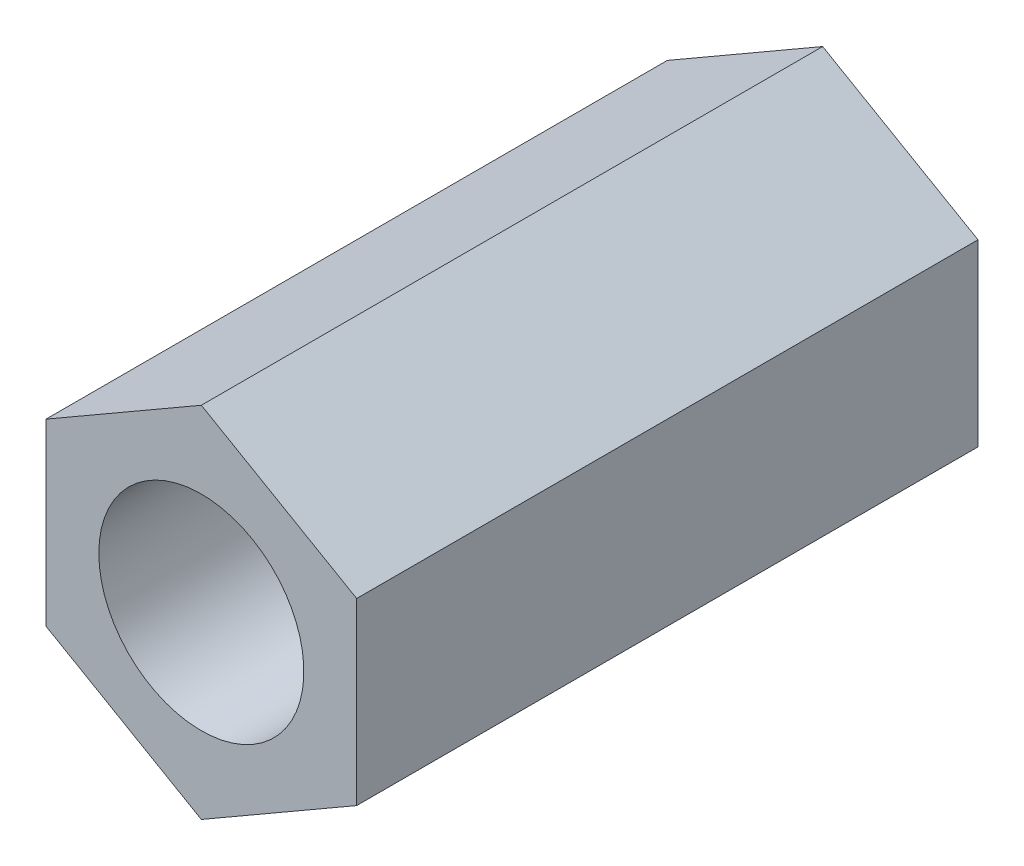
ISO-10303-21;
HEADER;
FILE_DESCRIPTION(('STEP AP214'),'2;1');
FILE_NAME('part.step','',(''),(''),'','','');
FILE_SCHEMA(('AUTOMOTIVE_DESIGN { 1 0 10303 214 1 1 1 1 }'));
ENDSEC;
DATA;
#1=APPLICATION_CONTEXT('core data for automotive mechanical design processes');
#2=APPLICATION_PROTOCOL_DEFINITION('international standard','automotive_design',2000,#1);
#3=PRODUCT_CONTEXT('',#1,'mechanical');
#4=PRODUCT('Part','Part','',(#3));
#5=PRODUCT_RELATED_PRODUCT_CATEGORY('part','',(#4));
#6=PRODUCT_DEFINITION_FORMATION('','',#4);
#7=PRODUCT_DEFINITION_CONTEXT('part definition',#1,'design');
#8=PRODUCT_DEFINITION('design','',#6,#7);
#9=PRODUCT_DEFINITION_SHAPE('','',#8);
#10=(LENGTH_UNIT() NAMED_UNIT(*) SI_UNIT(.MILLI.,.METRE.));
#11=(NAMED_UNIT(*) PLANE_ANGLE_UNIT() SI_UNIT($,.RADIAN.));
#12=(NAMED_UNIT(*) SI_UNIT($,.STERADIAN.) SOLID_ANGLE_UNIT());
#13=UNCERTAINTY_MEASURE_WITH_UNIT(LENGTH_MEASURE(1.E-05),#10,'distance_accuracy_value','');
#14=(GEOMETRIC_REPRESENTATION_CONTEXT(3) GLOBAL_UNCERTAINTY_ASSIGNED_CONTEXT((#13)) GLOBAL_UNIT_ASSIGNED_CONTEXT((#10,
#11,#12)) REPRESENTATION_CONTEXT('',''));
#15=CARTESIAN_POINT('',(0.,0.,0.));
#16=DIRECTION('',(0.,0.,1.));
#17=DIRECTION('',(1.,0.,0.));
#18=AXIS2_PLACEMENT_3D('',#15,#16,#17);
#19=CARTESIAN_POINT('',(0.,-3.66617420935412,12.7));
#20=DIRECTION('',(-0.5,0.866025403784439,0.));
#21=DIRECTION('',(-0.866025403784439,-0.5,0.));
#22=AXIS2_PLACEMENT_3D('',#19,#20,#21);
#23=PLANE('',#22);
#24=DIRECTION('',(0.866025403784439,0.5,0.));
#25=VECTOR('',#24,1.);
#26=CARTESIAN_POINT('',(0.,-3.66617420935412,12.7));
#27=LINE('',#26,#25);
#28=CARTESIAN_POINT('',(0.,-3.66617420935412,12.7));
#29=VERTEX_POINT('',#28);
#30=CARTESIAN_POINT('',(3.175,-1.83308710467706,12.7));
#31=VERTEX_POINT('',#30);
#32=EDGE_CURVE('E109',#29,#31,#27,.T.);
#33=ORIENTED_EDGE('',*,*,#32,.F.);
#34=DIRECTION('',(0.,0.,1.));
#35=VECTOR('',#34,1.);
#36=CARTESIAN_POINT('',(0.,-3.66617420935412,12.7));
#37=LINE('',#36,#35);
#38=CARTESIAN_POINT('',(0.,-3.66617420935412,0.));
#39=VERTEX_POINT('',#38);
#40=EDGE_CURVE('E94',#29,#39,#37,.F.);
#41=ORIENTED_EDGE('',*,*,#40,.T.);
#42=DIRECTION('',(0.866025403784439,0.5,0.));
#43=VECTOR('',#42,1.);
#44=CARTESIAN_POINT('',(0.,-3.66617420935412,0.));
#45=LINE('',#44,#43);
#46=CARTESIAN_POINT('',(3.175,-1.83308710467706,0.));
#47=VERTEX_POINT('',#46);
#48=EDGE_CURVE('E110',#39,#47,#45,.T.);
#49=ORIENTED_EDGE('',*,*,#48,.T.);
#50=DIRECTION('',(0.,0.,1.));
#51=VECTOR('',#50,1.);
#52=CARTESIAN_POINT('',(3.175,-1.83308710467706,12.7));
#53=LINE('',#52,#51);
#54=EDGE_CURVE('E103',#47,#31,#53,.T.);
#55=ORIENTED_EDGE('',*,*,#54,.T.);
#56=EDGE_LOOP('',(#33,#41,#49,#55));
#57=FACE_BOUND('',#56,.T.);
#58=ADVANCED_FACE('F17',(#57),#23,.F.);
#59=CARTESIAN_POINT('',(3.175,-1.83308710467706,12.7));
#60=DIRECTION('',(-1.,0.,0.));
#61=DIRECTION('',(0.,-1.,0.));
#62=AXIS2_PLACEMENT_3D('',#59,#60,#61);
#63=PLANE('',#62);
#64=DIRECTION('',(0.,1.,0.));
#65=VECTOR('',#64,1.);
#66=CARTESIAN_POINT('',(3.175,3.66617420935412,12.7));
#67=LINE('',#66,#65);
#68=CARTESIAN_POINT('',(3.175,1.83308710467706,12.7));
#69=VERTEX_POINT('',#68);
#70=EDGE_CURVE('E112',#31,#69,#67,.T.);
#71=ORIENTED_EDGE('',*,*,#70,.F.);
#72=ORIENTED_EDGE('',*,*,#54,.F.);
#73=DIRECTION('',(0.,1.,0.));
#74=VECTOR('',#73,1.);
#75=CARTESIAN_POINT('',(3.175,3.66617420935412,0.));
#76=LINE('',#75,#74);
#77=CARTESIAN_POINT('',(3.175,1.83308710467706,0.));
#78=VERTEX_POINT('',#77);
#79=EDGE_CURVE('E117',#47,#78,#76,.T.);
#80=ORIENTED_EDGE('',*,*,#79,.T.);
#81=DIRECTION('',(0.,0.,1.));
#82=VECTOR('',#81,1.);
#83=CARTESIAN_POINT('',(3.175,1.83308710467706,12.7));
#84=LINE('',#83,#82);
#85=EDGE_CURVE('E66',#78,#69,#84,.T.);
#86=ORIENTED_EDGE('',*,*,#85,.T.);
#87=EDGE_LOOP('',(#71,#72,#80,#86));
#88=FACE_BOUND('',#87,.T.);
#89=ADVANCED_FACE('F113',(#88),#63,.F.);
#90=CARTESIAN_POINT('',(3.175,1.83308710467706,12.7));
#91=DIRECTION('',(-0.5,-0.866025403784439,0.));
#92=DIRECTION('',(0.866025403784439,-0.5,0.));
#93=AXIS2_PLACEMENT_3D('',#90,#91,#92);
#94=PLANE('',#93);
#95=DIRECTION('',(-0.866025403784439,0.5,0.));
#96=VECTOR('',#95,1.);
#97=CARTESIAN_POINT('',(3.175,1.83308710467706,12.7));
#98=LINE('',#97,#96);
#99=CARTESIAN_POINT('',(0.,3.66617420935412,12.7));
#100=VERTEX_POINT('',#99);
#101=EDGE_CURVE('E114',#69,#100,#98,.T.);
#102=ORIENTED_EDGE('',*,*,#101,.F.);
#103=ORIENTED_EDGE('',*,*,#85,.F.);
#104=DIRECTION('',(-0.866025403784438,0.5,0.));
#105=VECTOR('',#104,1.);
#106=CARTESIAN_POINT('',(3.175,1.83308710467706,0.));
#107=LINE('',#106,#105);
#108=CARTESIAN_POINT('',(0.,3.66617420935412,0.));
#109=VERTEX_POINT('',#108);
#110=EDGE_CURVE('E87',#78,#109,#107,.T.);
#111=ORIENTED_EDGE('',*,*,#110,.T.);
#112=DIRECTION('',(0.,0.,1.));
#113=VECTOR('',#112,1.);
#114=CARTESIAN_POINT('',(0.,3.66617420935412,12.7));
#115=LINE('',#114,#113);
#116=EDGE_CURVE('E73',#109,#100,#115,.T.);
#117=ORIENTED_EDGE('',*,*,#116,.T.);
#118=EDGE_LOOP('',(#102,#103,#111,#117));
#119=FACE_BOUND('',#118,.T.);
#120=ADVANCED_FACE('F93',(#119),#94,.F.);
#121=CARTESIAN_POINT('',(0.,3.66617420935412,12.7));
#122=DIRECTION('',(0.5,-0.866025403784439,0.));
#123=DIRECTION('',(0.866025403784439,0.5,0.));
#124=AXIS2_PLACEMENT_3D('',#121,#122,#123);
#125=PLANE('',#124);
#126=DIRECTION('',(-0.866025403784439,-0.5,0.));
#127=VECTOR('',#126,1.);
#128=CARTESIAN_POINT('',(0.,3.66617420935412,12.7));
#129=LINE('',#128,#127);
#130=CARTESIAN_POINT('',(-3.175,1.83308710467706,12.7));
#131=VERTEX_POINT('',#130);
#132=EDGE_CURVE('E78',#100,#131,#129,.T.);
#133=ORIENTED_EDGE('',*,*,#132,.F.);
#134=ORIENTED_EDGE('',*,*,#116,.F.);
#135=DIRECTION('',(-0.866025403784439,-0.5,0.));
#136=VECTOR('',#135,1.);
#137=CARTESIAN_POINT('',(0.,3.66617420935412,0.));
#138=LINE('',#137,#136);
#139=CARTESIAN_POINT('',(-3.175,1.83308710467706,0.));
#140=VERTEX_POINT('',#139);
#141=EDGE_CURVE('E77',#109,#140,#138,.T.);
#142=ORIENTED_EDGE('',*,*,#141,.T.);
#143=DIRECTION('',(0.,0.,1.));
#144=VECTOR('',#143,1.);
#145=CARTESIAN_POINT('',(-3.175,1.83308710467706,12.7));
#146=LINE('',#145,#144);
#147=EDGE_CURVE('E79',#140,#131,#146,.T.);
#148=ORIENTED_EDGE('',*,*,#147,.T.);
#149=EDGE_LOOP('',(#133,#134,#142,#148));
#150=FACE_BOUND('',#149,.T.);
#151=ADVANCED_FACE('F75',(#150),#125,.F.);
#152=CARTESIAN_POINT('',(-3.175,1.83308710467706,12.7));
#153=DIRECTION('',(1.,0.,0.));
#154=DIRECTION('',(0.,1.,0.));
#155=AXIS2_PLACEMENT_3D('',#152,#153,#154);
#156=PLANE('',#155);
#157=DIRECTION('',(0.,1.,0.));
#158=VECTOR('',#157,1.);
#159=CARTESIAN_POINT('',(-3.175,3.66617420935412,12.7));
#160=LINE('',#159,#158);
#161=CARTESIAN_POINT('',(-3.175,-1.83308710467706,12.7));
#162=VERTEX_POINT('',#161);
#163=EDGE_CURVE('E33',#131,#162,#160,.F.);
#164=ORIENTED_EDGE('',*,*,#163,.F.);
#165=ORIENTED_EDGE('',*,*,#147,.F.);
#166=DIRECTION('',(0.,1.,0.));
#167=VECTOR('',#166,1.);
#168=CARTESIAN_POINT('',(-3.175,3.66617420935412,0.));
#169=LINE('',#168,#167);
#170=CARTESIAN_POINT('',(-3.175,-1.83308710467706,0.));
#171=VERTEX_POINT('',#170);
#172=EDGE_CURVE('E91',#140,#171,#169,.F.);
#173=ORIENTED_EDGE('',*,*,#172,.T.);
#174=DIRECTION('',(0.,0.,1.));
#175=VECTOR('',#174,1.);
#176=CARTESIAN_POINT('',(-3.175,-1.83308710467706,12.7));
#177=LINE('',#176,#175);
#178=EDGE_CURVE('E96',#171,#162,#177,.T.);
#179=ORIENTED_EDGE('',*,*,#178,.T.);
#180=EDGE_LOOP('',(#164,#165,#173,#179));
#181=FACE_BOUND('',#180,.T.);
#182=ADVANCED_FACE('F126',(#181),#156,.F.);
#183=CARTESIAN_POINT('',(-3.175,-1.83308710467706,12.7));
#184=DIRECTION('',(0.5,0.866025403784439,0.));
#185=DIRECTION('',(-0.866025403784439,0.5,0.));
#186=AXIS2_PLACEMENT_3D('',#183,#184,#185);
#187=PLANE('',#186);
#188=DIRECTION('',(0.866025403784438,-0.5,0.));
#189=VECTOR('',#188,1.);
#190=CARTESIAN_POINT('',(-3.175,-1.83308710467706,12.7));
#191=LINE('',#190,#189);
#192=EDGE_CURVE('E128',#162,#29,#191,.T.);
#193=ORIENTED_EDGE('',*,*,#192,.F.);
#194=ORIENTED_EDGE('',*,*,#178,.F.);
#195=DIRECTION('',(0.866025403784438,-0.5,0.));
#196=VECTOR('',#195,1.);
#197=CARTESIAN_POINT('',(-3.175,-1.83308710467706,0.));
#198=LINE('',#197,#196);
#199=EDGE_CURVE('E123',#171,#39,#198,.T.);
#200=ORIENTED_EDGE('',*,*,#199,.T.);
#201=ORIENTED_EDGE('',*,*,#40,.F.);
#202=EDGE_LOOP('',(#193,#194,#200,#201));
#203=FACE_BOUND('',#202,.T.);
#204=ADVANCED_FACE('F148',(#203),#187,.F.);
#205=CARTESIAN_POINT('',(0.,3.66617420935412,0.));
#206=DIRECTION('',(0.,0.,1.));
#207=DIRECTION('',(1.,0.,0.));
#208=AXIS2_PLACEMENT_3D('',#205,#206,#207);
#209=PLANE('',#208);
#210=ORIENTED_EDGE('',*,*,#48,.F.);
#211=ORIENTED_EDGE('',*,*,#199,.F.);
#212=ORIENTED_EDGE('',*,*,#172,.F.);
#213=ORIENTED_EDGE('',*,*,#141,.F.);
#214=ORIENTED_EDGE('',*,*,#110,.F.);
#215=ORIENTED_EDGE('',*,*,#79,.F.);
#216=EDGE_LOOP('',(#210,#211,#212,#213,#214,#215));
#217=FACE_BOUND('',#216,.T.);
#218=CARTESIAN_POINT('',(0.,0.,0.));
#219=DIRECTION('',(0.,0.,-1.));
#220=DIRECTION('',(-1.,0.,0.));
#221=AXIS2_PLACEMENT_3D('',#218,#219,#220);
#222=CIRCLE('',#221,2.0955);
#223=CARTESIAN_POINT('',(-2.0955,0.,0.));
#224=VERTEX_POINT('',#223);
#225=EDGE_CURVE('E20',#224,#224,#222,.F.);
#226=ORIENTED_EDGE('',*,*,#225,.T.);
#227=EDGE_LOOP('',(#226));
#228=FACE_BOUND('',#227,.T.);
#229=ADVANCED_FACE('F84',(#217,#228),#209,.F.);
#230=CARTESIAN_POINT('',(0.,3.66617420935412,12.7));
#231=DIRECTION('',(0.,0.,1.));
#232=DIRECTION('',(1.,0.,0.));
#233=AXIS2_PLACEMENT_3D('',#230,#231,#232);
#234=PLANE('',#233);
#235=ORIENTED_EDGE('',*,*,#163,.T.);
#236=ORIENTED_EDGE('',*,*,#192,.T.);
#237=ORIENTED_EDGE('',*,*,#32,.T.);
#238=ORIENTED_EDGE('',*,*,#70,.T.);
#239=ORIENTED_EDGE('',*,*,#101,.T.);
#240=ORIENTED_EDGE('',*,*,#132,.T.);
#241=EDGE_LOOP('',(#235,#236,#237,#238,#239,#240));
#242=FACE_BOUND('',#241,.T.);
#243=CARTESIAN_POINT('',(0.,0.,12.7));
#244=DIRECTION('',(0.,0.,-1.));
#245=DIRECTION('',(-1.,0.,0.));
#246=AXIS2_PLACEMENT_3D('',#243,#244,#245);
#247=CIRCLE('',#246,2.0955);
#248=CARTESIAN_POINT('',(-2.0955,0.,12.7));
#249=VERTEX_POINT('',#248);
#250=EDGE_CURVE('E11',#249,#249,#247,.T.);
#251=ORIENTED_EDGE('',*,*,#250,.T.);
#252=EDGE_LOOP('',(#251));
#253=FACE_BOUND('',#252,.T.);
#254=ADVANCED_FACE('F131',(#242,#253),#234,.T.);
#255=CARTESIAN_POINT('',(0.,0.,12.7));
#256=DIRECTION('',(0.,0.,-1.));
#257=DIRECTION('',(-1.,0.,0.));
#258=AXIS2_PLACEMENT_3D('',#255,#256,#257);
#259=CYLINDRICAL_SURFACE('',#258,2.0955);
#260=ORIENTED_EDGE('',*,*,#225,.F.);
#261=EDGE_LOOP('',(#260));
#262=FACE_BOUND('',#261,.T.);
#263=ORIENTED_EDGE('',*,*,#250,.F.);
#264=EDGE_LOOP('',(#263));
#265=FACE_BOUND('',#264,.T.);
#266=ADVANCED_FACE('F134',(#262,#265),#259,.F.);
#267=CLOSED_SHELL('',(#58,#89,#120,#151,#182,#204,#229,#254,#266));
#268=MANIFOLD_SOLID_BREP('B1',#267);
#269=ADVANCED_BREP_SHAPE_REPRESENTATION('',(#18,#268),#14);
#270=SHAPE_DEFINITION_REPRESENTATION(#9,#269);
ENDSEC;
END-ISO-10303-21;
